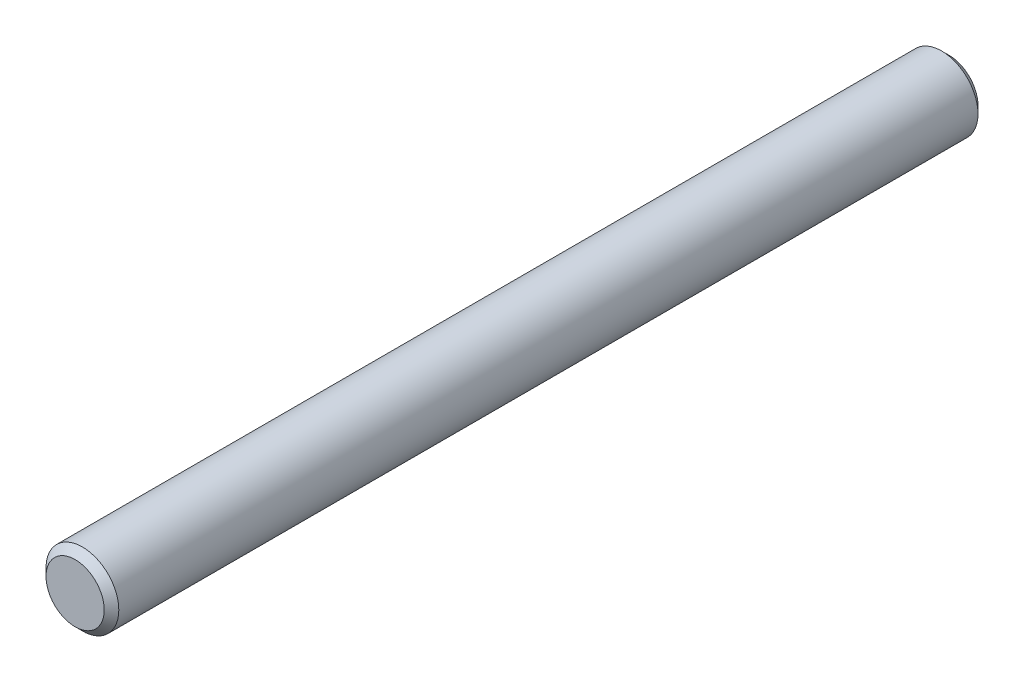
ISO-10303-21;
HEADER;
FILE_DESCRIPTION(('STEP AP214'),'2;1');
FILE_NAME('part.step','',(''),(''),'','','');
FILE_SCHEMA(('AUTOMOTIVE_DESIGN { 1 0 10303 214 1 1 1 1 }'));
ENDSEC;
DATA;
#1=APPLICATION_CONTEXT('core data for automotive mechanical design processes');
#2=APPLICATION_PROTOCOL_DEFINITION('international standard','automotive_design',2000,#1);
#3=PRODUCT_CONTEXT('',#1,'mechanical');
#4=PRODUCT('Part','Part','',(#3));
#5=PRODUCT_RELATED_PRODUCT_CATEGORY('part','',(#4));
#6=PRODUCT_DEFINITION_FORMATION('','',#4);
#7=PRODUCT_DEFINITION_CONTEXT('part definition',#1,'design');
#8=PRODUCT_DEFINITION('design','',#6,#7);
#9=PRODUCT_DEFINITION_SHAPE('','',#8);
#10=(LENGTH_UNIT() NAMED_UNIT(*) SI_UNIT(.MILLI.,.METRE.));
#11=(NAMED_UNIT(*) PLANE_ANGLE_UNIT() SI_UNIT($,.RADIAN.));
#12=(NAMED_UNIT(*) SI_UNIT($,.STERADIAN.) SOLID_ANGLE_UNIT());
#13=UNCERTAINTY_MEASURE_WITH_UNIT(LENGTH_MEASURE(1.E-05),#10,'distance_accuracy_value','');
#14=(GEOMETRIC_REPRESENTATION_CONTEXT(3) GLOBAL_UNCERTAINTY_ASSIGNED_CONTEXT((#13)) GLOBAL_UNIT_ASSIGNED_CONTEXT((#10,
#11,#12)) REPRESENTATION_CONTEXT('',''));
#15=CARTESIAN_POINT('',(0.,0.,0.));
#16=DIRECTION('',(0.,0.,1.));
#17=DIRECTION('',(1.,0.,0.));
#18=AXIS2_PLACEMENT_3D('',#15,#16,#17);
#19=CARTESIAN_POINT('',(0.,0.,38.1));
#20=DIRECTION('',(0.,0.,-1.));
#21=DIRECTION('',(-1.,0.,0.));
#22=AXIS2_PLACEMENT_3D('',#19,#20,#21);
#23=CYLINDRICAL_SURFACE('',#22,3.175);
#24=CARTESIAN_POINT('',(0.,0.,-37.4649999999999));
#25=DIRECTION('',(0.,0.,1.));
#26=DIRECTION('',(1.,0.,0.));
#27=AXIS2_PLACEMENT_3D('',#24,#25,#26);
#28=CIRCLE('',#27,3.175);
#29=CARTESIAN_POINT('',(3.175,0.,-37.4649999999999));
#30=VERTEX_POINT('',#29);
#31=EDGE_CURVE('E45',#30,#30,#28,.T.);
#32=ORIENTED_EDGE('',*,*,#31,.T.);
#33=EDGE_LOOP('',(#32));
#34=FACE_BOUND('',#33,.T.);
#35=CARTESIAN_POINT('',(0.,0.,37.465));
#36=DIRECTION('',(0.,0.,1.));
#37=DIRECTION('',(1.,0.,0.));
#38=AXIS2_PLACEMENT_3D('',#35,#36,#37);
#39=CIRCLE('',#38,3.175);
#40=CARTESIAN_POINT('',(3.175,0.,37.465));
#41=VERTEX_POINT('',#40);
#42=EDGE_CURVE('E49',#41,#41,#39,.F.);
#43=ORIENTED_EDGE('',*,*,#42,.T.);
#44=EDGE_LOOP('',(#43));
#45=FACE_BOUND('',#44,.T.);
#46=ADVANCED_FACE('F34',(#34,#45),#23,.T.);
#47=CARTESIAN_POINT('',(0.,0.,38.1));
#48=DIRECTION('',(0.,0.,1.));
#49=DIRECTION('',(1.,0.,0.));
#50=AXIS2_PLACEMENT_3D('',#47,#48,#49);
#51=PLANE('',#50);
#52=CARTESIAN_POINT('',(0.,0.,38.1));
#53=DIRECTION('',(0.,0.,1.));
#54=DIRECTION('',(1.,0.,0.));
#55=AXIS2_PLACEMENT_3D('',#52,#53,#54);
#56=CIRCLE('',#55,2.54000000000002);
#57=CARTESIAN_POINT('',(2.54000000000002,0.,38.1));
#58=VERTEX_POINT('',#57);
#59=EDGE_CURVE('E10',#58,#58,#56,.T.);
#60=ORIENTED_EDGE('',*,*,#59,.T.);
#61=EDGE_LOOP('',(#60));
#62=FACE_BOUND('',#61,.T.);
#63=ADVANCED_FACE('F65',(#62),#51,.T.);
#64=CARTESIAN_POINT('',(0.,0.,-38.1));
#65=DIRECTION('',(0.,0.,1.));
#66=DIRECTION('',(1.,0.,0.));
#67=AXIS2_PLACEMENT_3D('',#64,#65,#66);
#68=PLANE('',#67);
#69=CARTESIAN_POINT('',(0.,0.,-38.1));
#70=DIRECTION('',(0.,0.,1.));
#71=DIRECTION('',(1.,0.,0.));
#72=AXIS2_PLACEMENT_3D('',#69,#70,#71);
#73=CIRCLE('',#72,2.53999999999994);
#74=CARTESIAN_POINT('',(2.53999999999994,0.,-38.1));
#75=VERTEX_POINT('',#74);
#76=EDGE_CURVE('E41',#75,#75,#73,.F.);
#77=ORIENTED_EDGE('',*,*,#76,.T.);
#78=EDGE_LOOP('',(#77));
#79=FACE_BOUND('',#78,.T.);
#80=ADVANCED_FACE('F62',(#79),#68,.F.);
#81=CARTESIAN_POINT('',(0.,0.,-37.4649999999999));
#82=DIRECTION('',(0.,0.,1.));
#83=DIRECTION('',(1.,0.,0.));
#84=AXIS2_PLACEMENT_3D('',#81,#82,#83);
#85=CONICAL_SURFACE('',#84,3.175,0.785398163397445);
#86=ORIENTED_EDGE('',*,*,#76,.F.);
#87=EDGE_LOOP('',(#86));
#88=FACE_BOUND('',#87,.T.);
#89=ORIENTED_EDGE('',*,*,#31,.F.);
#90=EDGE_LOOP('',(#89));
#91=FACE_BOUND('',#90,.T.);
#92=ADVANCED_FACE('F58',(#88,#91),#85,.T.);
#93=CARTESIAN_POINT('',(0.,0.,38.1));
#94=DIRECTION('',(0.,0.,-1.));
#95=DIRECTION('',(-1.,0.,0.));
#96=AXIS2_PLACEMENT_3D('',#93,#94,#95);
#97=CONICAL_SURFACE('',#96,2.54000000000002,0.785398163397445);
#98=ORIENTED_EDGE('',*,*,#42,.F.);
#99=EDGE_LOOP('',(#98));
#100=FACE_BOUND('',#99,.T.);
#101=ORIENTED_EDGE('',*,*,#59,.F.);
#102=EDGE_LOOP('',(#101));
#103=FACE_BOUND('',#102,.T.);
#104=ADVANCED_FACE('F36',(#100,#103),#97,.T.);
#105=CLOSED_SHELL('',(#46,#63,#80,#92,#104));
#106=MANIFOLD_SOLID_BREP('B2',#105);
#107=ADVANCED_BREP_SHAPE_REPRESENTATION('',(#18,#106),#14);
#108=SHAPE_DEFINITION_REPRESENTATION(#9,#107);
ENDSEC;
END-ISO-10303-21;
